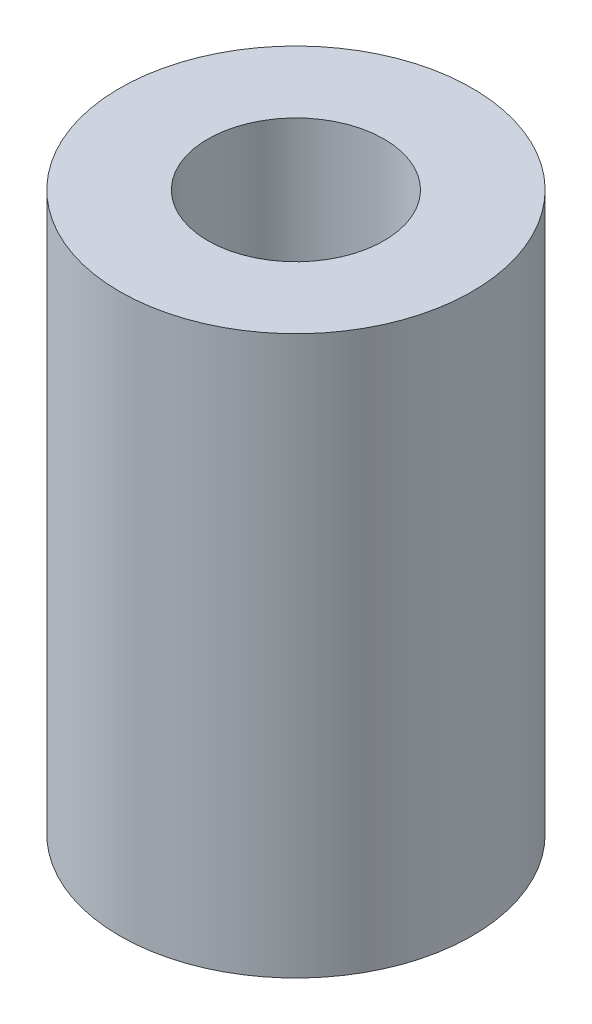
ISO-10303-21;
HEADER;
FILE_DESCRIPTION(('STEP AP214'),'2;1');
FILE_NAME('part.step','',(''),(''),'','','');
FILE_SCHEMA(('AUTOMOTIVE_DESIGN { 1 0 10303 214 1 1 1 1 }'));
ENDSEC;
DATA;
#1=APPLICATION_CONTEXT('core data for automotive mechanical design processes');
#2=APPLICATION_PROTOCOL_DEFINITION('international standard','automotive_design',2000,#1);
#3=PRODUCT_CONTEXT('',#1,'mechanical');
#4=PRODUCT('Part','Part','',(#3));
#5=PRODUCT_RELATED_PRODUCT_CATEGORY('part','',(#4));
#6=PRODUCT_DEFINITION_FORMATION('','',#4);
#7=PRODUCT_DEFINITION_CONTEXT('part definition',#1,'design');
#8=PRODUCT_DEFINITION('design','',#6,#7);
#9=PRODUCT_DEFINITION_SHAPE('','',#8);
#10=(LENGTH_UNIT() NAMED_UNIT(*) SI_UNIT(.MILLI.,.METRE.));
#11=(NAMED_UNIT(*) PLANE_ANGLE_UNIT() SI_UNIT($,.RADIAN.));
#12=(NAMED_UNIT(*) SI_UNIT($,.STERADIAN.) SOLID_ANGLE_UNIT());
#13=UNCERTAINTY_MEASURE_WITH_UNIT(LENGTH_MEASURE(1.E-05),#10,'distance_accuracy_value','');
#14=(GEOMETRIC_REPRESENTATION_CONTEXT(3) GLOBAL_UNCERTAINTY_ASSIGNED_CONTEXT((#13)) GLOBAL_UNIT_ASSIGNED_CONTEXT((#10,
#11,#12)) REPRESENTATION_CONTEXT('',''));
#15=CARTESIAN_POINT('',(0.,0.,0.));
#16=DIRECTION('',(0.,0.,1.));
#17=DIRECTION('',(1.,0.,0.));
#18=AXIS2_PLACEMENT_3D('',#15,#16,#17);
#19=CARTESIAN_POINT('',(0.,19.,0.));
#20=DIRECTION('',(0.,1.,0.));
#21=DIRECTION('',(0.,0.,1.));
#22=AXIS2_PLACEMENT_3D('',#19,#20,#21);
#23=PLANE('',#22);
#24=CARTESIAN_POINT('',(0.,19.,0.));
#25=DIRECTION('',(0.,1.,0.));
#26=DIRECTION('',(0.,0.,1.));
#27=AXIS2_PLACEMENT_3D('',#24,#25,#26);
#28=CIRCLE('',#27,6.);
#29=CARTESIAN_POINT('',(0.,19.,6.));
#30=VERTEX_POINT('',#29);
#31=EDGE_CURVE('E10',#30,#30,#28,.T.);
#32=ORIENTED_EDGE('',*,*,#31,.T.);
#33=EDGE_LOOP('',(#32));
#34=FACE_BOUND('',#33,.T.);
#35=CARTESIAN_POINT('',(0.,19.,0.));
#36=DIRECTION('',(0.,1.,0.));
#37=DIRECTION('',(0.,0.,1.));
#38=AXIS2_PLACEMENT_3D('',#35,#36,#37);
#39=CIRCLE('',#38,3.);
#40=CARTESIAN_POINT('',(0.,19.,3.));
#41=VERTEX_POINT('',#40);
#42=EDGE_CURVE('E51',#41,#41,#39,.T.);
#43=ORIENTED_EDGE('',*,*,#42,.F.);
#44=EDGE_LOOP('',(#43));
#45=FACE_BOUND('',#44,.T.);
#46=ADVANCED_FACE('F40',(#34,#45),#23,.T.);
#47=CARTESIAN_POINT('',(0.,0.,0.));
#48=DIRECTION('',(0.,1.,0.));
#49=DIRECTION('',(0.,0.,1.));
#50=AXIS2_PLACEMENT_3D('',#47,#48,#49);
#51=PLANE('',#50);
#52=CARTESIAN_POINT('',(0.,0.,0.));
#53=DIRECTION('',(0.,1.,0.));
#54=DIRECTION('',(0.,0.,1.));
#55=AXIS2_PLACEMENT_3D('',#52,#53,#54);
#56=CIRCLE('',#55,6.);
#57=CARTESIAN_POINT('',(0.,0.,6.));
#58=VERTEX_POINT('',#57);
#59=EDGE_CURVE('E44',#58,#58,#56,.T.);
#60=ORIENTED_EDGE('',*,*,#59,.F.);
#61=EDGE_LOOP('',(#60));
#62=FACE_BOUND('',#61,.T.);
#63=CARTESIAN_POINT('',(0.,0.,0.));
#64=DIRECTION('',(0.,1.,0.));
#65=DIRECTION('',(0.,0.,1.));
#66=AXIS2_PLACEMENT_3D('',#63,#64,#65);
#67=CIRCLE('',#66,3.);
#68=CARTESIAN_POINT('',(0.,0.,3.));
#69=VERTEX_POINT('',#68);
#70=EDGE_CURVE('E53',#69,#69,#67,.T.);
#71=ORIENTED_EDGE('',*,*,#70,.T.);
#72=EDGE_LOOP('',(#71));
#73=FACE_BOUND('',#72,.T.);
#74=ADVANCED_FACE('F63',(#62,#73),#51,.F.);
#75=CARTESIAN_POINT('',(0.,19.,0.));
#76=DIRECTION('',(0.,-1.,0.));
#77=DIRECTION('',(0.,0.,-1.));
#78=AXIS2_PLACEMENT_3D('',#75,#76,#77);
#79=CYLINDRICAL_SURFACE('',#78,6.);
#80=ORIENTED_EDGE('',*,*,#31,.F.);
#81=EDGE_LOOP('',(#80));
#82=FACE_BOUND('',#81,.T.);
#83=ORIENTED_EDGE('',*,*,#59,.T.);
#84=EDGE_LOOP('',(#83));
#85=FACE_BOUND('',#84,.T.);
#86=ADVANCED_FACE('F42',(#82,#85),#79,.T.);
#87=CARTESIAN_POINT('',(0.,19.,0.));
#88=DIRECTION('',(0.,-1.,0.));
#89=DIRECTION('',(0.,0.,-1.));
#90=AXIS2_PLACEMENT_3D('',#87,#88,#89);
#91=CYLINDRICAL_SURFACE('',#90,3.);
#92=ORIENTED_EDGE('',*,*,#42,.T.);
#93=EDGE_LOOP('',(#92));
#94=FACE_BOUND('',#93,.T.);
#95=ORIENTED_EDGE('',*,*,#70,.F.);
#96=EDGE_LOOP('',(#95));
#97=FACE_BOUND('',#96,.T.);
#98=ADVANCED_FACE('F59',(#94,#97),#91,.F.);
#99=CLOSED_SHELL('',(#46,#74,#86,#98));
#100=MANIFOLD_SOLID_BREP('B2',#99);
#101=ADVANCED_BREP_SHAPE_REPRESENTATION('',(#18,#100),#14);
#102=SHAPE_DEFINITION_REPRESENTATION(#9,#101);
ENDSEC;
END-ISO-10303-21;
